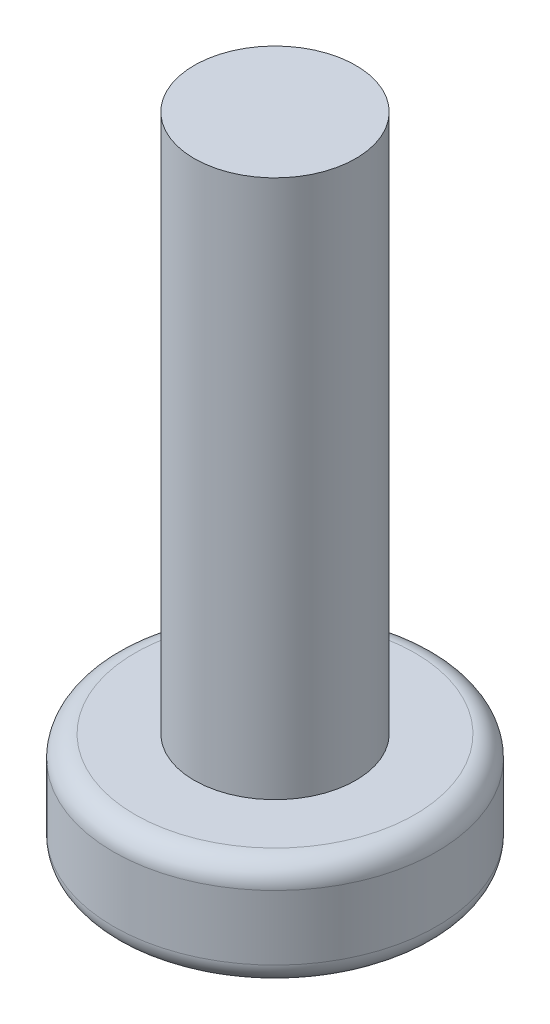
ISO-10303-21;
HEADER;
FILE_DESCRIPTION(('STEP AP214'),'2;1');
FILE_NAME('part.step','',(''),(''),'','','');
FILE_SCHEMA(('AUTOMOTIVE_DESIGN { 1 0 10303 214 1 1 1 1 }'));
ENDSEC;
DATA;
#1=APPLICATION_CONTEXT('core data for automotive mechanical design processes');
#2=APPLICATION_PROTOCOL_DEFINITION('international standard','automotive_design',2000,#1);
#3=PRODUCT_CONTEXT('',#1,'mechanical');
#4=PRODUCT('Part','Part','',(#3));
#5=PRODUCT_RELATED_PRODUCT_CATEGORY('part','',(#4));
#6=PRODUCT_DEFINITION_FORMATION('','',#4);
#7=PRODUCT_DEFINITION_CONTEXT('part definition',#1,'design');
#8=PRODUCT_DEFINITION('design','',#6,#7);
#9=PRODUCT_DEFINITION_SHAPE('','',#8);
#10=(LENGTH_UNIT() NAMED_UNIT(*) SI_UNIT(.MILLI.,.METRE.));
#11=(NAMED_UNIT(*) PLANE_ANGLE_UNIT() SI_UNIT($,.RADIAN.));
#12=(NAMED_UNIT(*) SI_UNIT($,.STERADIAN.) SOLID_ANGLE_UNIT());
#13=UNCERTAINTY_MEASURE_WITH_UNIT(LENGTH_MEASURE(1.E-05),#10,'distance_accuracy_value','');
#14=(GEOMETRIC_REPRESENTATION_CONTEXT(3) GLOBAL_UNCERTAINTY_ASSIGNED_CONTEXT((#13)) GLOBAL_UNIT_ASSIGNED_CONTEXT((#10,
#11,#12)) REPRESENTATION_CONTEXT('',''));
#15=CARTESIAN_POINT('',(0.,0.,0.));
#16=DIRECTION('',(0.,0.,1.));
#17=DIRECTION('',(1.,0.,0.));
#18=AXIS2_PLACEMENT_3D('',#15,#16,#17);
#19=CARTESIAN_POINT('',(0.,2.,0.));
#20=DIRECTION('',(0.,1.,0.));
#21=DIRECTION('',(0.,0.,1.));
#22=AXIS2_PLACEMENT_3D('',#19,#20,#21);
#23=PLANE('',#22);
#24=CARTESIAN_POINT('',(0.,2.,0.));
#25=DIRECTION('',(0.,1.,0.));
#26=DIRECTION('',(0.,0.,1.));
#27=AXIS2_PLACEMENT_3D('',#24,#25,#26);
#28=CIRCLE('',#27,2.6);
#29=CARTESIAN_POINT('',(0.,2.,2.6));
#30=VERTEX_POINT('',#29);
#31=EDGE_CURVE('E213',#30,#30,#28,.T.);
#32=ORIENTED_EDGE('',*,*,#31,.T.);
#33=EDGE_LOOP('',(#32));
#34=FACE_BOUND('',#33,.T.);
#35=CARTESIAN_POINT('',(0.,2.,0.));
#36=DIRECTION('',(0.,1.,0.));
#37=DIRECTION('',(0.,0.,1.));
#38=AXIS2_PLACEMENT_3D('',#35,#36,#37);
#39=CIRCLE('',#38,1.5);
#40=CARTESIAN_POINT('',(0.,2.,1.5));
#41=VERTEX_POINT('',#40);
#42=EDGE_CURVE('E192',#41,#41,#39,.T.);
#43=ORIENTED_EDGE('',*,*,#42,.F.);
#44=EDGE_LOOP('',(#43));
#45=FACE_BOUND('',#44,.T.);
#46=ADVANCED_FACE('F33',(#34,#45),#23,.T.);
#47=CARTESIAN_POINT('',(0.,2.,0.));
#48=DIRECTION('',(0.,-1.,0.));
#49=DIRECTION('',(0.,0.,-1.));
#50=AXIS2_PLACEMENT_3D('',#47,#48,#49);
#51=CYLINDRICAL_SURFACE('',#50,3.);
#52=CARTESIAN_POINT('',(0.,1.6,0.));
#53=DIRECTION('',(0.,1.,0.));
#54=DIRECTION('',(0.,0.,1.));
#55=AXIS2_PLACEMENT_3D('',#52,#53,#54);
#56=CIRCLE('',#55,3.);
#57=CARTESIAN_POINT('',(0.,1.6,3.));
#58=VERTEX_POINT('',#57);
#59=EDGE_CURVE('E41',#58,#58,#56,.F.);
#60=ORIENTED_EDGE('',*,*,#59,.T.);
#61=EDGE_LOOP('',(#60));
#62=FACE_BOUND('',#61,.T.);
#63=CARTESIAN_POINT('',(0.,0.4,0.));
#64=DIRECTION('',(0.,1.,0.));
#65=DIRECTION('',(0.,0.,1.));
#66=AXIS2_PLACEMENT_3D('',#63,#64,#65);
#67=CIRCLE('',#66,3.);
#68=CARTESIAN_POINT('',(0.,0.4,3.));
#69=VERTEX_POINT('',#68);
#70=EDGE_CURVE('E218',#69,#69,#67,.T.);
#71=ORIENTED_EDGE('',*,*,#70,.T.);
#72=EDGE_LOOP('',(#71));
#73=FACE_BOUND('',#72,.T.);
#74=ADVANCED_FACE('F223',(#62,#73),#51,.T.);
#75=CARTESIAN_POINT('',(0.,0.,0.));
#76=DIRECTION('',(0.,1.,0.));
#77=DIRECTION('',(0.,0.,1.));
#78=AXIS2_PLACEMENT_3D('',#75,#76,#77);
#79=PLANE('',#78);
#80=CARTESIAN_POINT('',(0.,0.,0.));
#81=DIRECTION('',(0.,1.,0.));
#82=DIRECTION('',(0.,0.,1.));
#83=AXIS2_PLACEMENT_3D('',#80,#81,#82);
#84=CIRCLE('',#83,2.6);
#85=CARTESIAN_POINT('',(0.,0.,2.6));
#86=VERTEX_POINT('',#85);
#87=EDGE_CURVE('E11',#86,#86,#84,.F.);
#88=ORIENTED_EDGE('',*,*,#87,.T.);
#89=EDGE_LOOP('',(#88));
#90=FACE_BOUND('',#89,.T.);
#91=DIRECTION('',(1.,0.,0.));
#92=VECTOR('',#91,1.);
#93=CARTESIAN_POINT('',(0.,0.,0.45));
#94=LINE('',#93,#92);
#95=CARTESIAN_POINT('',(-1.5,0.,0.45));
#96=VERTEX_POINT('',#95);
#97=CARTESIAN_POINT('',(-0.45,0.,0.45));
#98=VERTEX_POINT('',#97);
#99=EDGE_CURVE('E160',#96,#98,#94,.T.);
#100=ORIENTED_EDGE('',*,*,#99,.T.);
#101=DIRECTION('',(0.,0.,-1.));
#102=VECTOR('',#101,1.);
#103=CARTESIAN_POINT('',(-0.45,0.,0.));
#104=LINE('',#103,#102);
#105=CARTESIAN_POINT('',(-0.45,0.,1.5));
#106=VERTEX_POINT('',#105);
#107=EDGE_CURVE('E48',#106,#98,#104,.T.);
#108=ORIENTED_EDGE('',*,*,#107,.F.);
#109=DIRECTION('',(1.,0.,0.));
#110=VECTOR('',#109,1.);
#111=CARTESIAN_POINT('',(0.,0.,1.5));
#112=LINE('',#111,#110);
#113=CARTESIAN_POINT('',(0.45,0.,1.5));
#114=VERTEX_POINT('',#113);
#115=EDGE_CURVE('E187',#106,#114,#112,.T.);
#116=ORIENTED_EDGE('',*,*,#115,.T.);
#117=DIRECTION('',(0.,0.,-1.));
#118=VECTOR('',#117,1.);
#119=CARTESIAN_POINT('',(0.45,0.,0.));
#120=LINE('',#119,#118);
#121=CARTESIAN_POINT('',(0.45,0.,0.45));
#122=VERTEX_POINT('',#121);
#123=EDGE_CURVE('E185',#114,#122,#120,.T.);
#124=ORIENTED_EDGE('',*,*,#123,.T.);
#125=DIRECTION('',(1.,0.,0.));
#126=VECTOR('',#125,1.);
#127=CARTESIAN_POINT('',(0.,0.,0.45));
#128=LINE('',#127,#126);
#129=CARTESIAN_POINT('',(1.5,0.,0.45));
#130=VERTEX_POINT('',#129);
#131=EDGE_CURVE('E143',#122,#130,#128,.T.);
#132=ORIENTED_EDGE('',*,*,#131,.T.);
#133=DIRECTION('',(0.,0.,-1.));
#134=VECTOR('',#133,1.);
#135=CARTESIAN_POINT('',(1.5,0.,0.));
#136=LINE('',#135,#134);
#137=CARTESIAN_POINT('',(1.5,0.,-0.45));
#138=VERTEX_POINT('',#137);
#139=EDGE_CURVE('E181',#130,#138,#136,.T.);
#140=ORIENTED_EDGE('',*,*,#139,.T.);
#141=DIRECTION('',(1.,0.,0.));
#142=VECTOR('',#141,1.);
#143=CARTESIAN_POINT('',(0.,0.,-0.45));
#144=LINE('',#143,#142);
#145=CARTESIAN_POINT('',(0.45,0.,-0.45));
#146=VERTEX_POINT('',#145);
#147=EDGE_CURVE('E178',#146,#138,#144,.T.);
#148=ORIENTED_EDGE('',*,*,#147,.F.);
#149=DIRECTION('',(0.,0.,-1.));
#150=VECTOR('',#149,1.);
#151=CARTESIAN_POINT('',(0.45,0.,0.));
#152=LINE('',#151,#150);
#153=CARTESIAN_POINT('',(0.45,0.,-1.5));
#154=VERTEX_POINT('',#153);
#155=EDGE_CURVE('E175',#146,#154,#152,.T.);
#156=ORIENTED_EDGE('',*,*,#155,.T.);
#157=DIRECTION('',(1.,0.,0.));
#158=VECTOR('',#157,1.);
#159=CARTESIAN_POINT('',(0.,0.,-1.5));
#160=LINE('',#159,#158);
#161=CARTESIAN_POINT('',(-0.45,0.,-1.5));
#162=VERTEX_POINT('',#161);
#163=EDGE_CURVE('E172',#162,#154,#160,.T.);
#164=ORIENTED_EDGE('',*,*,#163,.F.);
#165=DIRECTION('',(0.,0.,-1.));
#166=VECTOR('',#165,1.);
#167=CARTESIAN_POINT('',(-0.45,0.,0.));
#168=LINE('',#167,#166);
#169=CARTESIAN_POINT('',(-0.45,0.,-0.45));
#170=VERTEX_POINT('',#169);
#171=EDGE_CURVE('E169',#170,#162,#168,.T.);
#172=ORIENTED_EDGE('',*,*,#171,.F.);
#173=DIRECTION('',(1.,0.,0.));
#174=VECTOR('',#173,1.);
#175=CARTESIAN_POINT('',(0.,0.,-0.45));
#176=LINE('',#175,#174);
#177=CARTESIAN_POINT('',(-1.5,0.,-0.45));
#178=VERTEX_POINT('',#177);
#179=EDGE_CURVE('E166',#178,#170,#176,.T.);
#180=ORIENTED_EDGE('',*,*,#179,.F.);
#181=DIRECTION('',(0.,0.,-1.));
#182=VECTOR('',#181,1.);
#183=CARTESIAN_POINT('',(-1.5,0.,0.));
#184=LINE('',#183,#182);
#185=EDGE_CURVE('E163',#96,#178,#184,.T.);
#186=ORIENTED_EDGE('',*,*,#185,.F.);
#187=EDGE_LOOP('',(#100,#108,#116,#124,#132,#140,#148,#156,#164,#172,#180,#186));
#188=FACE_BOUND('',#187,.T.);
#189=ADVANCED_FACE('F239',(#90,#188),#79,.F.);
#190=CARTESIAN_POINT('',(0.,12.,0.));
#191=DIRECTION('',(0.,-1.,0.));
#192=DIRECTION('',(0.,0.,-1.));
#193=AXIS2_PLACEMENT_3D('',#190,#191,#192);
#194=CYLINDRICAL_SURFACE('',#193,1.5);
#195=CARTESIAN_POINT('',(0.,12.,0.));
#196=DIRECTION('',(0.,1.,0.));
#197=DIRECTION('',(0.,0.,1.));
#198=AXIS2_PLACEMENT_3D('',#195,#196,#197);
#199=CIRCLE('',#198,1.5);
#200=CARTESIAN_POINT('',(0.,12.,1.5));
#201=VERTEX_POINT('',#200);
#202=EDGE_CURVE('E210',#201,#201,#199,.T.);
#203=ORIENTED_EDGE('',*,*,#202,.F.);
#204=EDGE_LOOP('',(#203));
#205=FACE_BOUND('',#204,.T.);
#206=ORIENTED_EDGE('',*,*,#42,.T.);
#207=EDGE_LOOP('',(#206));
#208=FACE_BOUND('',#207,.T.);
#209=ADVANCED_FACE('F236',(#205,#208),#194,.T.);
#210=CARTESIAN_POINT('',(0.,12.,0.));
#211=DIRECTION('',(0.,1.,0.));
#212=DIRECTION('',(0.,0.,1.));
#213=AXIS2_PLACEMENT_3D('',#210,#211,#212);
#214=PLANE('',#213);
#215=ORIENTED_EDGE('',*,*,#202,.T.);
#216=EDGE_LOOP('',(#215));
#217=FACE_BOUND('',#216,.T.);
#218=ADVANCED_FACE('F238',(#217),#214,.T.);
#219=CARTESIAN_POINT('',(-0.45,1.9,0.));
#220=DIRECTION('',(-1.,0.,0.));
#221=DIRECTION('',(0.,0.,1.));
#222=AXIS2_PLACEMENT_3D('',#219,#220,#221);
#223=PLANE('',#222);
#224=ORIENTED_EDGE('',*,*,#107,.T.);
#225=DIRECTION('',(0.,-1.,0.));
#226=VECTOR('',#225,1.);
#227=CARTESIAN_POINT('',(-0.45,1.9,0.45));
#228=LINE('',#227,#226);
#229=CARTESIAN_POINT('',(-0.45,1.9,0.45));
#230=VERTEX_POINT('',#229);
#231=EDGE_CURVE('E158',#230,#98,#228,.T.);
#232=ORIENTED_EDGE('',*,*,#231,.F.);
#233=DIRECTION('',(0.,0.,-1.));
#234=VECTOR('',#233,1.);
#235=CARTESIAN_POINT('',(-0.45,1.9,0.));
#236=LINE('',#235,#234);
#237=CARTESIAN_POINT('',(-0.45,1.9,1.5));
#238=VERTEX_POINT('',#237);
#239=EDGE_CURVE('E190',#238,#230,#236,.T.);
#240=ORIENTED_EDGE('',*,*,#239,.F.);
#241=DIRECTION('',(0.,-1.,0.));
#242=VECTOR('',#241,1.);
#243=CARTESIAN_POINT('',(-0.45,1.9,1.5));
#244=LINE('',#243,#242);
#245=EDGE_CURVE('E56',#238,#106,#244,.T.);
#246=ORIENTED_EDGE('',*,*,#245,.T.);
#247=EDGE_LOOP('',(#224,#232,#240,#246));
#248=FACE_BOUND('',#247,.T.);
#249=ADVANCED_FACE('F246',(#248),#223,.F.);
#250=CARTESIAN_POINT('',(0.,1.9,1.5));
#251=DIRECTION('',(0.,0.,-1.));
#252=DIRECTION('',(-1.,0.,0.));
#253=AXIS2_PLACEMENT_3D('',#250,#251,#252);
#254=PLANE('',#253);
#255=ORIENTED_EDGE('',*,*,#115,.F.);
#256=ORIENTED_EDGE('',*,*,#245,.F.);
#257=DIRECTION('',(1.,0.,0.));
#258=VECTOR('',#257,1.);
#259=CARTESIAN_POINT('',(0.,1.9,1.5));
#260=LINE('',#259,#258);
#261=CARTESIAN_POINT('',(0.45,1.9,1.5));
#262=VERTEX_POINT('',#261);
#263=EDGE_CURVE('E136',#238,#262,#260,.T.);
#264=ORIENTED_EDGE('',*,*,#263,.T.);
#265=DIRECTION('',(0.,-1.,0.));
#266=VECTOR('',#265,1.);
#267=CARTESIAN_POINT('',(0.45,1.9,1.5));
#268=LINE('',#267,#266);
#269=EDGE_CURVE('E133',#262,#114,#268,.T.);
#270=ORIENTED_EDGE('',*,*,#269,.T.);
#271=EDGE_LOOP('',(#255,#256,#264,#270));
#272=FACE_BOUND('',#271,.T.);
#273=ADVANCED_FACE('F319',(#272),#254,.T.);
#274=CARTESIAN_POINT('',(0.45,1.9,0.));
#275=DIRECTION('',(-1.,0.,0.));
#276=DIRECTION('',(0.,0.,1.));
#277=AXIS2_PLACEMENT_3D('',#274,#275,#276);
#278=PLANE('',#277);
#279=ORIENTED_EDGE('',*,*,#123,.F.);
#280=ORIENTED_EDGE('',*,*,#269,.F.);
#281=DIRECTION('',(0.,0.,-1.));
#282=VECTOR('',#281,1.);
#283=CARTESIAN_POINT('',(0.45,1.9,0.));
#284=LINE('',#283,#282);
#285=CARTESIAN_POINT('',(0.45,1.9,0.45));
#286=VERTEX_POINT('',#285);
#287=EDGE_CURVE('E127',#262,#286,#284,.T.);
#288=ORIENTED_EDGE('',*,*,#287,.T.);
#289=DIRECTION('',(0.,-1.,0.));
#290=VECTOR('',#289,1.);
#291=CARTESIAN_POINT('',(0.45,1.9,0.45));
#292=LINE('',#291,#290);
#293=EDGE_CURVE('E131',#286,#122,#292,.T.);
#294=ORIENTED_EDGE('',*,*,#293,.T.);
#295=EDGE_LOOP('',(#279,#280,#288,#294));
#296=FACE_BOUND('',#295,.T.);
#297=ADVANCED_FACE('F130',(#296),#278,.T.);
#298=CARTESIAN_POINT('',(0.,1.9,0.45));
#299=DIRECTION('',(0.,0.,-1.));
#300=DIRECTION('',(-1.,0.,0.));
#301=AXIS2_PLACEMENT_3D('',#298,#299,#300);
#302=PLANE('',#301);
#303=ORIENTED_EDGE('',*,*,#131,.F.);
#304=ORIENTED_EDGE('',*,*,#293,.F.);
#305=DIRECTION('',(1.,0.,0.));
#306=VECTOR('',#305,1.);
#307=CARTESIAN_POINT('',(0.,1.9,0.45));
#308=LINE('',#307,#306);
#309=CARTESIAN_POINT('',(1.5,1.9,0.45));
#310=VERTEX_POINT('',#309);
#311=EDGE_CURVE('E137',#286,#310,#308,.T.);
#312=ORIENTED_EDGE('',*,*,#311,.T.);
#313=DIRECTION('',(0.,-1.,0.));
#314=VECTOR('',#313,1.);
#315=CARTESIAN_POINT('',(1.5,1.9,0.45));
#316=LINE('',#315,#314);
#317=EDGE_CURVE('E145',#310,#130,#316,.T.);
#318=ORIENTED_EDGE('',*,*,#317,.T.);
#319=EDGE_LOOP('',(#303,#304,#312,#318));
#320=FACE_BOUND('',#319,.T.);
#321=ADVANCED_FACE('F140',(#320),#302,.T.);
#322=CARTESIAN_POINT('',(1.5,1.9,0.));
#323=DIRECTION('',(-1.,0.,0.));
#324=DIRECTION('',(0.,0.,1.));
#325=AXIS2_PLACEMENT_3D('',#322,#323,#324);
#326=PLANE('',#325);
#327=ORIENTED_EDGE('',*,*,#139,.F.);
#328=ORIENTED_EDGE('',*,*,#317,.F.);
#329=DIRECTION('',(0.,0.,-1.));
#330=VECTOR('',#329,1.);
#331=CARTESIAN_POINT('',(1.5,1.9,0.));
#332=LINE('',#331,#330);
#333=CARTESIAN_POINT('',(1.5,1.9,-0.45));
#334=VERTEX_POINT('',#333);
#335=EDGE_CURVE('E151',#310,#334,#332,.T.);
#336=ORIENTED_EDGE('',*,*,#335,.T.);
#337=DIRECTION('',(0.,-1.,0.));
#338=VECTOR('',#337,1.);
#339=CARTESIAN_POINT('',(1.5,1.9,-0.45));
#340=LINE('',#339,#338);
#341=EDGE_CURVE('E195',#334,#138,#340,.T.);
#342=ORIENTED_EDGE('',*,*,#341,.T.);
#343=EDGE_LOOP('',(#327,#328,#336,#342));
#344=FACE_BOUND('',#343,.T.);
#345=ADVANCED_FACE('F318',(#344),#326,.T.);
#346=CARTESIAN_POINT('',(0.,1.9,-0.45));
#347=DIRECTION('',(0.,0.,-1.));
#348=DIRECTION('',(-1.,0.,0.));
#349=AXIS2_PLACEMENT_3D('',#346,#347,#348);
#350=PLANE('',#349);
#351=ORIENTED_EDGE('',*,*,#147,.T.);
#352=ORIENTED_EDGE('',*,*,#341,.F.);
#353=DIRECTION('',(1.,0.,0.));
#354=VECTOR('',#353,1.);
#355=CARTESIAN_POINT('',(0.,1.9,-0.45));
#356=LINE('',#355,#354);
#357=CARTESIAN_POINT('',(0.45,1.9,-0.45));
#358=VERTEX_POINT('',#357);
#359=EDGE_CURVE('E153',#358,#334,#356,.T.);
#360=ORIENTED_EDGE('',*,*,#359,.F.);
#361=DIRECTION('',(0.,-1.,0.));
#362=VECTOR('',#361,1.);
#363=CARTESIAN_POINT('',(0.45,1.9,-0.45));
#364=LINE('',#363,#362);
#365=EDGE_CURVE('E197',#358,#146,#364,.T.);
#366=ORIENTED_EDGE('',*,*,#365,.T.);
#367=EDGE_LOOP('',(#351,#352,#360,#366));
#368=FACE_BOUND('',#367,.T.);
#369=ADVANCED_FACE('F313',(#368),#350,.F.);
#370=CARTESIAN_POINT('',(0.45,1.9,0.));
#371=DIRECTION('',(-1.,0.,0.));
#372=DIRECTION('',(0.,0.,1.));
#373=AXIS2_PLACEMENT_3D('',#370,#371,#372);
#374=PLANE('',#373);
#375=ORIENTED_EDGE('',*,*,#155,.F.);
#376=ORIENTED_EDGE('',*,*,#365,.F.);
#377=DIRECTION('',(0.,0.,-1.));
#378=VECTOR('',#377,1.);
#379=CARTESIAN_POINT('',(0.45,1.9,0.));
#380=LINE('',#379,#378);
#381=CARTESIAN_POINT('',(0.45,1.9,-1.5));
#382=VERTEX_POINT('',#381);
#383=EDGE_CURVE('E308',#358,#382,#380,.T.);
#384=ORIENTED_EDGE('',*,*,#383,.T.);
#385=DIRECTION('',(0.,-1.,0.));
#386=VECTOR('',#385,1.);
#387=CARTESIAN_POINT('',(0.45,1.9,-1.5));
#388=LINE('',#387,#386);
#389=EDGE_CURVE('E199',#382,#154,#388,.T.);
#390=ORIENTED_EDGE('',*,*,#389,.T.);
#391=EDGE_LOOP('',(#375,#376,#384,#390));
#392=FACE_BOUND('',#391,.T.);
#393=ADVANCED_FACE('F335',(#392),#374,.T.);
#394=CARTESIAN_POINT('',(0.,1.9,-1.5));
#395=DIRECTION('',(0.,0.,-1.));
#396=DIRECTION('',(-1.,0.,0.));
#397=AXIS2_PLACEMENT_3D('',#394,#395,#396);
#398=PLANE('',#397);
#399=ORIENTED_EDGE('',*,*,#163,.T.);
#400=ORIENTED_EDGE('',*,*,#389,.F.);
#401=DIRECTION('',(1.,0.,0.));
#402=VECTOR('',#401,1.);
#403=CARTESIAN_POINT('',(0.,1.9,-1.5));
#404=LINE('',#403,#402);
#405=CARTESIAN_POINT('',(-0.45,1.9,-1.5));
#406=VERTEX_POINT('',#405);
#407=EDGE_CURVE('E305',#406,#382,#404,.T.);
#408=ORIENTED_EDGE('',*,*,#407,.F.);
#409=DIRECTION('',(0.,-1.,0.));
#410=VECTOR('',#409,1.);
#411=CARTESIAN_POINT('',(-0.45,1.9,-1.5));
#412=LINE('',#411,#410);
#413=EDGE_CURVE('E201',#406,#162,#412,.T.);
#414=ORIENTED_EDGE('',*,*,#413,.T.);
#415=EDGE_LOOP('',(#399,#400,#408,#414));
#416=FACE_BOUND('',#415,.T.);
#417=ADVANCED_FACE('F338',(#416),#398,.F.);
#418=CARTESIAN_POINT('',(-0.45,1.9,0.));
#419=DIRECTION('',(-1.,0.,0.));
#420=DIRECTION('',(0.,0.,1.));
#421=AXIS2_PLACEMENT_3D('',#418,#419,#420);
#422=PLANE('',#421);
#423=ORIENTED_EDGE('',*,*,#171,.T.);
#424=ORIENTED_EDGE('',*,*,#413,.F.);
#425=DIRECTION('',(0.,0.,-1.));
#426=VECTOR('',#425,1.);
#427=CARTESIAN_POINT('',(-0.45,1.9,0.));
#428=LINE('',#427,#426);
#429=CARTESIAN_POINT('',(-0.45,1.9,-0.45));
#430=VERTEX_POINT('',#429);
#431=EDGE_CURVE('E302',#430,#406,#428,.T.);
#432=ORIENTED_EDGE('',*,*,#431,.F.);
#433=DIRECTION('',(0.,-1.,0.));
#434=VECTOR('',#433,1.);
#435=CARTESIAN_POINT('',(-0.45,1.9,-0.45));
#436=LINE('',#435,#434);
#437=EDGE_CURVE('E203',#430,#170,#436,.T.);
#438=ORIENTED_EDGE('',*,*,#437,.T.);
#439=EDGE_LOOP('',(#423,#424,#432,#438));
#440=FACE_BOUND('',#439,.T.);
#441=ADVANCED_FACE('F342',(#440),#422,.F.);
#442=CARTESIAN_POINT('',(0.,1.9,-0.45));
#443=DIRECTION('',(0.,0.,-1.));
#444=DIRECTION('',(-1.,0.,0.));
#445=AXIS2_PLACEMENT_3D('',#442,#443,#444);
#446=PLANE('',#445);
#447=ORIENTED_EDGE('',*,*,#179,.T.);
#448=ORIENTED_EDGE('',*,*,#437,.F.);
#449=DIRECTION('',(1.,0.,0.));
#450=VECTOR('',#449,1.);
#451=CARTESIAN_POINT('',(0.,1.9,-0.45));
#452=LINE('',#451,#450);
#453=CARTESIAN_POINT('',(-1.5,1.9,-0.45));
#454=VERTEX_POINT('',#453);
#455=EDGE_CURVE('E299',#454,#430,#452,.T.);
#456=ORIENTED_EDGE('',*,*,#455,.F.);
#457=DIRECTION('',(0.,-1.,0.));
#458=VECTOR('',#457,1.);
#459=CARTESIAN_POINT('',(-1.5,1.9,-0.45));
#460=LINE('',#459,#458);
#461=EDGE_CURVE('E205',#454,#178,#460,.T.);
#462=ORIENTED_EDGE('',*,*,#461,.T.);
#463=EDGE_LOOP('',(#447,#448,#456,#462));
#464=FACE_BOUND('',#463,.T.);
#465=ADVANCED_FACE('F346',(#464),#446,.F.);
#466=CARTESIAN_POINT('',(-1.5,1.9,0.));
#467=DIRECTION('',(-1.,0.,0.));
#468=DIRECTION('',(0.,0.,1.));
#469=AXIS2_PLACEMENT_3D('',#466,#467,#468);
#470=PLANE('',#469);
#471=ORIENTED_EDGE('',*,*,#185,.T.);
#472=ORIENTED_EDGE('',*,*,#461,.F.);
#473=DIRECTION('',(0.,0.,-1.));
#474=VECTOR('',#473,1.);
#475=CARTESIAN_POINT('',(-1.5,1.9,0.));
#476=LINE('',#475,#474);
#477=CARTESIAN_POINT('',(-1.5,1.9,0.45));
#478=VERTEX_POINT('',#477);
#479=EDGE_CURVE('E295',#478,#454,#476,.T.);
#480=ORIENTED_EDGE('',*,*,#479,.F.);
#481=DIRECTION('',(0.,-1.,0.));
#482=VECTOR('',#481,1.);
#483=CARTESIAN_POINT('',(-1.5,1.9,0.45));
#484=LINE('',#483,#482);
#485=EDGE_CURVE('E207',#478,#96,#484,.T.);
#486=ORIENTED_EDGE('',*,*,#485,.T.);
#487=EDGE_LOOP('',(#471,#472,#480,#486));
#488=FACE_BOUND('',#487,.T.);
#489=ADVANCED_FACE('F350',(#488),#470,.F.);
#490=CARTESIAN_POINT('',(0.,1.9,0.45));
#491=DIRECTION('',(0.,0.,-1.));
#492=DIRECTION('',(-1.,0.,0.));
#493=AXIS2_PLACEMENT_3D('',#490,#491,#492);
#494=PLANE('',#493);
#495=ORIENTED_EDGE('',*,*,#99,.F.);
#496=ORIENTED_EDGE('',*,*,#485,.F.);
#497=DIRECTION('',(1.,0.,0.));
#498=VECTOR('',#497,1.);
#499=CARTESIAN_POINT('',(0.,1.9,0.45));
#500=LINE('',#499,#498);
#501=EDGE_CURVE('E100',#478,#230,#500,.T.);
#502=ORIENTED_EDGE('',*,*,#501,.T.);
#503=ORIENTED_EDGE('',*,*,#231,.T.);
#504=EDGE_LOOP('',(#495,#496,#502,#503));
#505=FACE_BOUND('',#504,.T.);
#506=ADVANCED_FACE('F291',(#505),#494,.T.);
#507=CARTESIAN_POINT('',(0.,1.9,0.));
#508=DIRECTION('',(0.,-1.,0.));
#509=DIRECTION('',(0.,0.,-1.));
#510=AXIS2_PLACEMENT_3D('',#507,#508,#509);
#511=PLANE('',#510);
#512=ORIENTED_EDGE('',*,*,#239,.T.);
#513=ORIENTED_EDGE('',*,*,#501,.F.);
#514=ORIENTED_EDGE('',*,*,#479,.T.);
#515=ORIENTED_EDGE('',*,*,#455,.T.);
#516=ORIENTED_EDGE('',*,*,#431,.T.);
#517=ORIENTED_EDGE('',*,*,#407,.T.);
#518=ORIENTED_EDGE('',*,*,#383,.F.);
#519=ORIENTED_EDGE('',*,*,#359,.T.);
#520=ORIENTED_EDGE('',*,*,#335,.F.);
#521=ORIENTED_EDGE('',*,*,#311,.F.);
#522=ORIENTED_EDGE('',*,*,#287,.F.);
#523=ORIENTED_EDGE('',*,*,#263,.F.);
#524=EDGE_LOOP('',(#512,#513,#514,#515,#516,#517,#518,#519,#520,#521,#522,#523));
#525=FACE_BOUND('',#524,.T.);
#526=ADVANCED_FACE('F149',(#525),#511,.T.);
#527=CARTESIAN_POINT('',(0.,1.6,0.));
#528=DIRECTION('',(0.,1.,0.));
#529=DIRECTION('',(0.,0.,1.));
#530=AXIS2_PLACEMENT_3D('',#527,#528,#529);
#531=TOROIDAL_SURFACE('',#530,2.6,0.4);
#532=ORIENTED_EDGE('',*,*,#59,.F.);
#533=EDGE_LOOP('',(#532));
#534=FACE_BOUND('',#533,.T.);
#535=ORIENTED_EDGE('',*,*,#31,.F.);
#536=EDGE_LOOP('',(#535));
#537=FACE_BOUND('',#536,.T.);
#538=ADVANCED_FACE('F226',(#534,#537),#531,.T.);
#539=CARTESIAN_POINT('',(0.,0.4,0.));
#540=DIRECTION('',(0.,1.,0.));
#541=DIRECTION('',(0.,0.,1.));
#542=AXIS2_PLACEMENT_3D('',#539,#540,#541);
#543=TOROIDAL_SURFACE('',#542,2.6,0.4);
#544=ORIENTED_EDGE('',*,*,#87,.F.);
#545=EDGE_LOOP('',(#544));
#546=FACE_BOUND('',#545,.T.);
#547=ORIENTED_EDGE('',*,*,#70,.F.);
#548=EDGE_LOOP('',(#547));
#549=FACE_BOUND('',#548,.T.);
#550=ADVANCED_FACE('F35',(#546,#549),#543,.T.);
#551=CLOSED_SHELL('',(#46,#74,#189,#209,#218,#249,#273,#297,#321,#345,#369,#393,#417,#441,#465,
#489,#506,#526,#538,#550));
#552=MANIFOLD_SOLID_BREP('B2',#551);
#553=ADVANCED_BREP_SHAPE_REPRESENTATION('',(#18,#552),#14);
#554=SHAPE_DEFINITION_REPRESENTATION(#9,#553);
ENDSEC;
END-ISO-10303-21;
